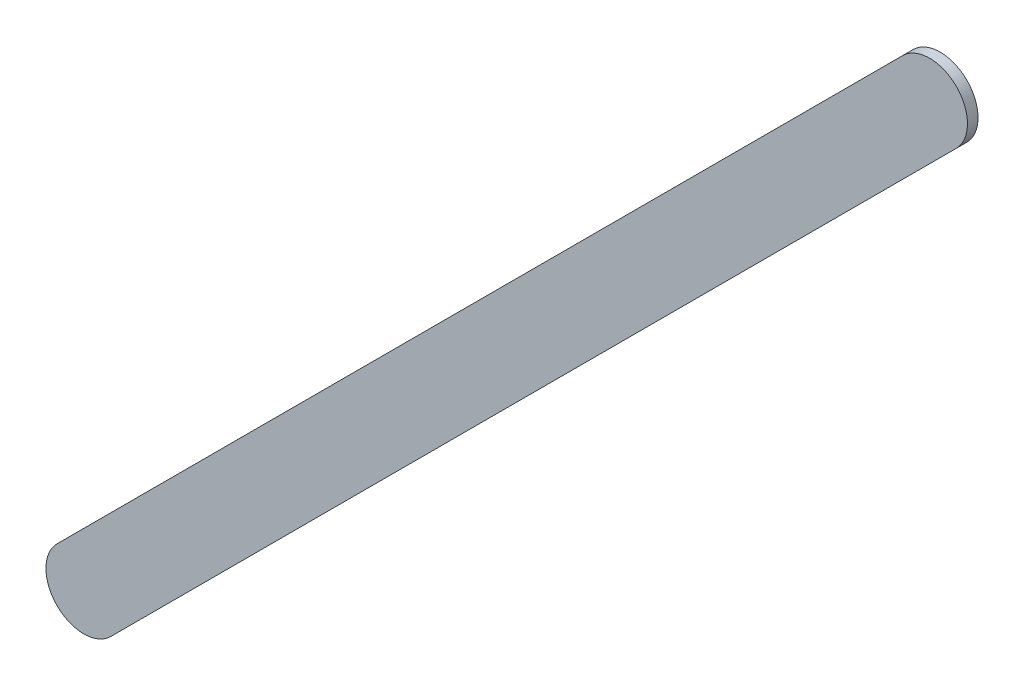
ISO-10303-21;
HEADER;
FILE_DESCRIPTION(('STEP AP214'),'2;1');
FILE_NAME('part.step','',(''),(''),'','','');
FILE_SCHEMA(('AUTOMOTIVE_DESIGN { 1 0 10303 214 1 1 1 1 }'));
ENDSEC;
DATA;
#1=APPLICATION_CONTEXT('core data for automotive mechanical design processes');
#2=APPLICATION_PROTOCOL_DEFINITION('international standard','automotive_design',2000,#1);
#3=PRODUCT_CONTEXT('',#1,'mechanical');
#4=PRODUCT('Part','Part','',(#3));
#5=PRODUCT_RELATED_PRODUCT_CATEGORY('part','',(#4));
#6=PRODUCT_DEFINITION_FORMATION('','',#4);
#7=PRODUCT_DEFINITION_CONTEXT('part definition',#1,'design');
#8=PRODUCT_DEFINITION('design','',#6,#7);
#9=PRODUCT_DEFINITION_SHAPE('','',#8);
#10=(LENGTH_UNIT() NAMED_UNIT(*) SI_UNIT(.MILLI.,.METRE.));
#11=(NAMED_UNIT(*) PLANE_ANGLE_UNIT() SI_UNIT($,.RADIAN.));
#12=(NAMED_UNIT(*) SI_UNIT($,.STERADIAN.) SOLID_ANGLE_UNIT());
#13=UNCERTAINTY_MEASURE_WITH_UNIT(LENGTH_MEASURE(1.E-05),#10,'distance_accuracy_value','');
#14=(GEOMETRIC_REPRESENTATION_CONTEXT(3) GLOBAL_UNCERTAINTY_ASSIGNED_CONTEXT((#13)) GLOBAL_UNIT_ASSIGNED_CONTEXT((#10,
#11,#12)) REPRESENTATION_CONTEXT('',''));
#15=CARTESIAN_POINT('',(0.,0.,0.));
#16=DIRECTION('',(0.,0.,1.));
#17=DIRECTION('',(1.,0.,0.));
#18=AXIS2_PLACEMENT_3D('',#15,#16,#17);
#19=CARTESIAN_POINT('',(94.77248254,50.39717124,0.));
#20=DIRECTION('',(-0.707106781186547,0.707106781186549,0.));
#21=DIRECTION('',(0.707106781186549,0.707106781186547,0.));
#22=AXIS2_PLACEMENT_3D('',#19,#20,#21);
#23=PLANE('',#22);
#24=DIRECTION('',(0.707106781186549,0.707106781186547,0.));
#25=VECTOR('',#24,1.);
#26=CARTESIAN_POINT('',(94.77248254,50.39717124,0.03556));
#27=LINE('',#26,#25);
#28=CARTESIAN_POINT('',(94.77248254,50.39717124,0.03556));
#29=VERTEX_POINT('',#28);
#30=CARTESIAN_POINT('',(97.6067517,53.2314404,0.03556));
#31=VERTEX_POINT('',#30);
#32=EDGE_CURVE('E11',#29,#31,#27,.T.);
#33=ORIENTED_EDGE('',*,*,#32,.F.);
#34=DIRECTION('',(0.,0.,1.));
#35=VECTOR('',#34,1.);
#36=CARTESIAN_POINT('',(94.77248254,50.39717124,0.));
#37=LINE('',#36,#35);
#38=CARTESIAN_POINT('',(94.77248254,50.39717124,0.));
#39=VERTEX_POINT('',#38);
#40=EDGE_CURVE('E24',#39,#29,#37,.T.);
#41=ORIENTED_EDGE('',*,*,#40,.F.);
#42=DIRECTION('',(0.707106781186549,0.707106781186547,0.));
#43=VECTOR('',#42,1.);
#44=CARTESIAN_POINT('',(94.77248254,50.39717124,0.));
#45=LINE('',#44,#43);
#46=CARTESIAN_POINT('',(97.6067517,53.2314404,0.));
#47=VERTEX_POINT('',#46);
#48=EDGE_CURVE('E75',#39,#47,#45,.T.);
#49=ORIENTED_EDGE('',*,*,#48,.T.);
#50=DIRECTION('',(0.,0.,1.));
#51=VECTOR('',#50,1.);
#52=CARTESIAN_POINT('',(97.6067517,53.2314404,0.));
#53=LINE('',#52,#51);
#54=EDGE_CURVE('E37',#47,#31,#53,.T.);
#55=ORIENTED_EDGE('',*,*,#54,.T.);
#56=EDGE_LOOP('',(#33,#41,#49,#55));
#57=FACE_BOUND('',#56,.T.);
#58=ADVANCED_FACE('F17',(#57),#23,.F.);
#59=CARTESIAN_POINT('',(97.51695,53.3212421,0.));
#60=DIRECTION('',(0.,0.,-1.));
#61=DIRECTION('',(0.707106781186548,-0.707106781186548,0.));
#62=AXIS2_PLACEMENT_3D('',#59,#60,#61);
#63=CYLINDRICAL_SURFACE('',#62,0.12699878206416);
#64=CARTESIAN_POINT('',(97.51695,53.3212421,0.03556));
#65=DIRECTION('',(0.,0.,1.));
#66=DIRECTION('',(0.707106781186548,-0.707106781186548,0.));
#67=AXIS2_PLACEMENT_3D('',#64,#65,#66);
#68=CIRCLE('',#67,0.12699878206416);
#69=CARTESIAN_POINT('',(97.4271483,53.4110438,0.03556));
#70=VERTEX_POINT('',#69);
#71=EDGE_CURVE('E83',#31,#70,#68,.T.);
#72=ORIENTED_EDGE('',*,*,#71,.F.);
#73=ORIENTED_EDGE('',*,*,#54,.F.);
#74=CARTESIAN_POINT('',(97.51695,53.3212421,0.));
#75=DIRECTION('',(0.,0.,1.));
#76=DIRECTION('',(0.707106781186548,-0.707106781186548,0.));
#77=AXIS2_PLACEMENT_3D('',#74,#75,#76);
#78=CIRCLE('',#77,0.12699878206416);
#79=CARTESIAN_POINT('',(97.4271483,53.4110438,0.));
#80=VERTEX_POINT('',#79);
#81=EDGE_CURVE('E81',#47,#80,#78,.T.);
#82=ORIENTED_EDGE('',*,*,#81,.T.);
#83=DIRECTION('',(0.,0.,1.));
#84=VECTOR('',#83,1.);
#85=CARTESIAN_POINT('',(97.4271483,53.4110438,0.));
#86=LINE('',#85,#84);
#87=EDGE_CURVE('E67',#80,#70,#86,.T.);
#88=ORIENTED_EDGE('',*,*,#87,.T.);
#89=EDGE_LOOP('',(#72,#73,#82,#88));
#90=FACE_BOUND('',#89,.T.);
#91=ADVANCED_FACE('F89',(#90),#63,.T.);
#92=CARTESIAN_POINT('',(97.4271483,53.4110438,0.));
#93=DIRECTION('',(0.707106781186546,-0.707106781186549,0.));
#94=DIRECTION('',(-0.707106781186549,-0.707106781186546,0.));
#95=AXIS2_PLACEMENT_3D('',#92,#93,#94);
#96=PLANE('',#95);
#97=DIRECTION('',(-0.707106781186549,-0.707106781186546,0.));
#98=VECTOR('',#97,1.);
#99=CARTESIAN_POINT('',(97.4271483,53.4110438,0.03556));
#100=LINE('',#99,#98);
#101=CARTESIAN_POINT('',(94.59287914,50.57677464,0.03556));
#102=VERTEX_POINT('',#101);
#103=EDGE_CURVE('E71',#70,#102,#100,.T.);
#104=ORIENTED_EDGE('',*,*,#103,.F.);
#105=ORIENTED_EDGE('',*,*,#87,.F.);
#106=DIRECTION('',(-0.707106781186549,-0.707106781186546,0.));
#107=VECTOR('',#106,1.);
#108=CARTESIAN_POINT('',(97.4271483,53.4110438,0.));
#109=LINE('',#108,#107);
#110=CARTESIAN_POINT('',(94.59287914,50.57677464,0.));
#111=VERTEX_POINT('',#110);
#112=EDGE_CURVE('E63',#80,#111,#109,.T.);
#113=ORIENTED_EDGE('',*,*,#112,.T.);
#114=DIRECTION('',(0.,0.,1.));
#115=VECTOR('',#114,1.);
#116=CARTESIAN_POINT('',(94.59287914,50.57677464,0.));
#117=LINE('',#116,#115);
#118=EDGE_CURVE('E53',#111,#102,#117,.T.);
#119=ORIENTED_EDGE('',*,*,#118,.T.);
#120=EDGE_LOOP('',(#104,#105,#113,#119));
#121=FACE_BOUND('',#120,.T.);
#122=ADVANCED_FACE('F66',(#121),#96,.F.);
#123=CARTESIAN_POINT('',(94.68268084,50.48697294,0.));
#124=DIRECTION('',(0.,0.,-1.));
#125=DIRECTION('',(-0.70710678118652,0.707106781186576,0.));
#126=AXIS2_PLACEMENT_3D('',#123,#124,#125);
#127=CYLINDRICAL_SURFACE('',#126,0.126998782064162);
#128=CARTESIAN_POINT('',(94.68268084,50.48697294,0.03556));
#129=DIRECTION('',(0.,0.,1.));
#130=DIRECTION('',(-0.70710678118652,0.707106781186576,0.));
#131=AXIS2_PLACEMENT_3D('',#128,#129,#130);
#132=CIRCLE('',#131,0.126998782064162);
#133=EDGE_CURVE('E59',#102,#29,#132,.T.);
#134=ORIENTED_EDGE('',*,*,#133,.F.);
#135=ORIENTED_EDGE('',*,*,#118,.F.);
#136=CARTESIAN_POINT('',(94.68268084,50.48697294,0.));
#137=DIRECTION('',(0.,0.,1.));
#138=DIRECTION('',(-0.70710678118652,0.707106781186576,0.));
#139=AXIS2_PLACEMENT_3D('',#136,#137,#138);
#140=CIRCLE('',#139,0.126998782064162);
#141=EDGE_CURVE('E57',#111,#39,#140,.T.);
#142=ORIENTED_EDGE('',*,*,#141,.T.);
#143=ORIENTED_EDGE('',*,*,#40,.T.);
#144=EDGE_LOOP('',(#134,#135,#142,#143));
#145=FACE_BOUND('',#144,.T.);
#146=ADVANCED_FACE('F55',(#145),#127,.T.);
#147=CARTESIAN_POINT('',(94.77248254,50.39717124,0.));
#148=DIRECTION('',(0.,0.,-1.));
#149=DIRECTION('',(-1.,0.,0.));
#150=AXIS2_PLACEMENT_3D('',#147,#148,#149);
#151=PLANE('',#150);
#152=ORIENTED_EDGE('',*,*,#141,.F.);
#153=ORIENTED_EDGE('',*,*,#112,.F.);
#154=ORIENTED_EDGE('',*,*,#81,.F.);
#155=ORIENTED_EDGE('',*,*,#48,.F.);
#156=EDGE_LOOP('',(#152,#153,#154,#155));
#157=FACE_BOUND('',#156,.T.);
#158=ADVANCED_FACE('F74',(#157),#151,.T.);
#159=CARTESIAN_POINT('',(94.77248254,50.39717124,0.03556));
#160=DIRECTION('',(0.,0.,-1.));
#161=DIRECTION('',(-1.,0.,0.));
#162=AXIS2_PLACEMENT_3D('',#159,#160,#161);
#163=PLANE('',#162);
#164=ORIENTED_EDGE('',*,*,#32,.T.);
#165=ORIENTED_EDGE('',*,*,#71,.T.);
#166=ORIENTED_EDGE('',*,*,#103,.T.);
#167=ORIENTED_EDGE('',*,*,#133,.T.);
#168=EDGE_LOOP('',(#164,#165,#166,#167));
#169=FACE_BOUND('',#168,.T.);
#170=ADVANCED_FACE('F91',(#169),#163,.F.);
#171=CLOSED_SHELL('',(#58,#91,#122,#146,#158,#170));
#172=MANIFOLD_SOLID_BREP('B1',#171);
#173=ADVANCED_BREP_SHAPE_REPRESENTATION('',(#18,#172),#14);
#174=SHAPE_DEFINITION_REPRESENTATION(#9,#173);
ENDSEC;
END-ISO-10303-21;
